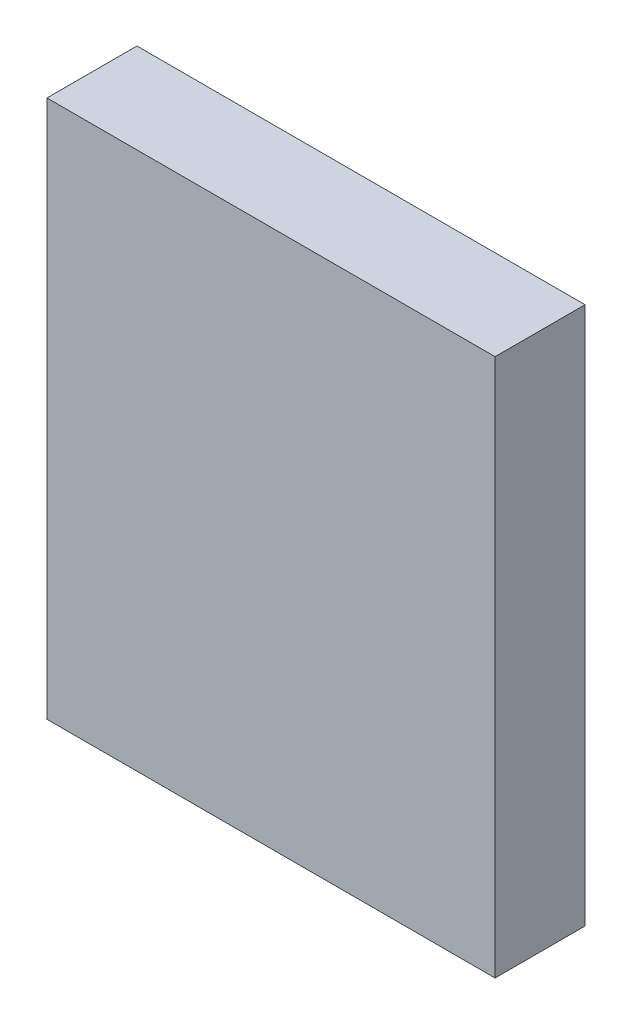
ISO-10303-21;
HEADER;
FILE_DESCRIPTION(('STEP AP214'),'2;1');
FILE_NAME('part.step','',(''),(''),'','','');
FILE_SCHEMA(('AUTOMOTIVE_DESIGN { 1 0 10303 214 1 1 1 1 }'));
ENDSEC;
DATA;
#1=APPLICATION_CONTEXT('core data for automotive mechanical design processes');
#2=APPLICATION_PROTOCOL_DEFINITION('international standard','automotive_design',2000,#1);
#3=PRODUCT_CONTEXT('',#1,'mechanical');
#4=PRODUCT('Part','Part','',(#3));
#5=PRODUCT_RELATED_PRODUCT_CATEGORY('part','',(#4));
#6=PRODUCT_DEFINITION_FORMATION('','',#4);
#7=PRODUCT_DEFINITION_CONTEXT('part definition',#1,'design');
#8=PRODUCT_DEFINITION('design','',#6,#7);
#9=PRODUCT_DEFINITION_SHAPE('','',#8);
#10=(LENGTH_UNIT() NAMED_UNIT(*) SI_UNIT(.MILLI.,.METRE.));
#11=(NAMED_UNIT(*) PLANE_ANGLE_UNIT() SI_UNIT($,.RADIAN.));
#12=(NAMED_UNIT(*) SI_UNIT($,.STERADIAN.) SOLID_ANGLE_UNIT());
#13=UNCERTAINTY_MEASURE_WITH_UNIT(LENGTH_MEASURE(1.E-05),#10,'distance_accuracy_value','');
#14=(GEOMETRIC_REPRESENTATION_CONTEXT(3) GLOBAL_UNCERTAINTY_ASSIGNED_CONTEXT((#13)) GLOBAL_UNIT_ASSIGNED_CONTEXT((#10,
#11,#12)) REPRESENTATION_CONTEXT('',''));
#15=CARTESIAN_POINT('',(0.,0.,0.));
#16=DIRECTION('',(0.,0.,1.));
#17=DIRECTION('',(1.,0.,0.));
#18=AXIS2_PLACEMENT_3D('',#15,#16,#17);
#19=CARTESIAN_POINT('',(-0.127,-1.003,0.));
#20=DIRECTION('',(0.,-1.,0.));
#21=DIRECTION('',(0.,0.,1.));
#22=AXIS2_PLACEMENT_3D('',#19,#20,#21);
#23=PLANE('',#22);
#24=DIRECTION('',(-1.,0.,0.));
#25=VECTOR('',#24,1.);
#26=CARTESIAN_POINT('',(0.127,-1.003,0.));
#27=LINE('',#26,#25);
#28=CARTESIAN_POINT('',(0.127,-1.003,0.));
#29=VERTEX_POINT('',#28);
#30=CARTESIAN_POINT('',(-0.127,-1.003,0.));
#31=VERTEX_POINT('',#30);
#32=EDGE_CURVE('E11',#29,#31,#27,.T.);
#33=ORIENTED_EDGE('',*,*,#32,.F.);
#34=DIRECTION('',(0.,0.,-1.));
#35=VECTOR('',#34,1.);
#36=CARTESIAN_POINT('',(0.127,-1.003,0.051));
#37=LINE('',#36,#35);
#38=CARTESIAN_POINT('',(0.127,-1.003,0.051));
#39=VERTEX_POINT('',#38);
#40=EDGE_CURVE('E24',#39,#29,#37,.T.);
#41=ORIENTED_EDGE('',*,*,#40,.F.);
#42=DIRECTION('',(1.,0.,0.));
#43=VECTOR('',#42,1.);
#44=CARTESIAN_POINT('',(-0.127,-1.003,0.051));
#45=LINE('',#44,#43);
#46=CARTESIAN_POINT('',(-0.127,-1.003,0.051));
#47=VERTEX_POINT('',#46);
#48=EDGE_CURVE('E88',#47,#39,#45,.T.);
#49=ORIENTED_EDGE('',*,*,#48,.F.);
#50=DIRECTION('',(0.,0.,1.));
#51=VECTOR('',#50,1.);
#52=CARTESIAN_POINT('',(-0.127,-1.003,0.));
#53=LINE('',#52,#51);
#54=EDGE_CURVE('E77',#31,#47,#53,.T.);
#55=ORIENTED_EDGE('',*,*,#54,.F.);
#56=EDGE_LOOP('',(#33,#41,#49,#55));
#57=FACE_BOUND('',#56,.T.);
#58=ADVANCED_FACE('F17',(#57),#23,.T.);
#59=CARTESIAN_POINT('',(0.127,-1.003,0.));
#60=DIRECTION('',(1.,0.,0.));
#61=DIRECTION('',(0.,0.,1.));
#62=AXIS2_PLACEMENT_3D('',#59,#60,#61);
#63=PLANE('',#62);
#64=DIRECTION('',(0.,-1.,0.));
#65=VECTOR('',#64,1.);
#66=CARTESIAN_POINT('',(0.127,-0.698,0.));
#67=LINE('',#66,#65);
#68=CARTESIAN_POINT('',(0.127,-0.698,0.));
#69=VERTEX_POINT('',#68);
#70=EDGE_CURVE('E85',#69,#29,#67,.T.);
#71=ORIENTED_EDGE('',*,*,#70,.F.);
#72=DIRECTION('',(0.,0.,-1.));
#73=VECTOR('',#72,1.);
#74=CARTESIAN_POINT('',(0.127,-0.698,0.051));
#75=LINE('',#74,#73);
#76=CARTESIAN_POINT('',(0.127,-0.698,0.051));
#77=VERTEX_POINT('',#76);
#78=EDGE_CURVE('E83',#77,#69,#75,.T.);
#79=ORIENTED_EDGE('',*,*,#78,.F.);
#80=DIRECTION('',(0.,1.,0.));
#81=VECTOR('',#80,1.);
#82=CARTESIAN_POINT('',(0.127,-1.003,0.051));
#83=LINE('',#82,#81);
#84=EDGE_CURVE('E72',#39,#77,#83,.T.);
#85=ORIENTED_EDGE('',*,*,#84,.F.);
#86=ORIENTED_EDGE('',*,*,#40,.T.);
#87=EDGE_LOOP('',(#71,#79,#85,#86));
#88=FACE_BOUND('',#87,.T.);
#89=ADVANCED_FACE('F90',(#88),#63,.T.);
#90=CARTESIAN_POINT('',(0.127,-0.698,0.));
#91=DIRECTION('',(0.,1.,0.));
#92=DIRECTION('',(0.,0.,1.));
#93=AXIS2_PLACEMENT_3D('',#90,#91,#92);
#94=PLANE('',#93);
#95=DIRECTION('',(1.,0.,0.));
#96=VECTOR('',#95,1.);
#97=CARTESIAN_POINT('',(-0.127,-0.698,0.));
#98=LINE('',#97,#96);
#99=CARTESIAN_POINT('',(-0.127,-0.698,0.));
#100=VERTEX_POINT('',#99);
#101=EDGE_CURVE('E60',#100,#69,#98,.T.);
#102=ORIENTED_EDGE('',*,*,#101,.F.);
#103=DIRECTION('',(0.,0.,-1.));
#104=VECTOR('',#103,1.);
#105=CARTESIAN_POINT('',(-0.127,-0.698,0.051));
#106=LINE('',#105,#104);
#107=CARTESIAN_POINT('',(-0.127,-0.698,0.051));
#108=VERTEX_POINT('',#107);
#109=EDGE_CURVE('E54',#108,#100,#106,.T.);
#110=ORIENTED_EDGE('',*,*,#109,.F.);
#111=DIRECTION('',(-1.,0.,0.));
#112=VECTOR('',#111,1.);
#113=CARTESIAN_POINT('',(0.127,-0.698,0.051));
#114=LINE('',#113,#112);
#115=EDGE_CURVE('E58',#77,#108,#114,.T.);
#116=ORIENTED_EDGE('',*,*,#115,.F.);
#117=ORIENTED_EDGE('',*,*,#78,.T.);
#118=EDGE_LOOP('',(#102,#110,#116,#117));
#119=FACE_BOUND('',#118,.T.);
#120=ADVANCED_FACE('F56',(#119),#94,.T.);
#121=CARTESIAN_POINT('',(-0.127,-0.698,0.));
#122=DIRECTION('',(-1.,0.,0.));
#123=DIRECTION('',(0.,0.,1.));
#124=AXIS2_PLACEMENT_3D('',#121,#122,#123);
#125=PLANE('',#124);
#126=DIRECTION('',(0.,1.,0.));
#127=VECTOR('',#126,1.);
#128=CARTESIAN_POINT('',(-0.127,-1.003,0.));
#129=LINE('',#128,#127);
#130=EDGE_CURVE('E73',#31,#100,#129,.T.);
#131=ORIENTED_EDGE('',*,*,#130,.F.);
#132=ORIENTED_EDGE('',*,*,#54,.T.);
#133=DIRECTION('',(0.,-1.,0.));
#134=VECTOR('',#133,1.);
#135=CARTESIAN_POINT('',(-0.127,-0.698,0.051));
#136=LINE('',#135,#134);
#137=EDGE_CURVE('E70',#108,#47,#136,.T.);
#138=ORIENTED_EDGE('',*,*,#137,.F.);
#139=ORIENTED_EDGE('',*,*,#109,.T.);
#140=EDGE_LOOP('',(#131,#132,#138,#139));
#141=FACE_BOUND('',#140,.T.);
#142=ADVANCED_FACE('F76',(#141),#125,.T.);
#143=CARTESIAN_POINT('',(-0.127,-0.698,0.));
#144=DIRECTION('',(0.,0.,-1.));
#145=DIRECTION('',(0.,1.,0.));
#146=AXIS2_PLACEMENT_3D('',#143,#144,#145);
#147=PLANE('',#146);
#148=ORIENTED_EDGE('',*,*,#101,.T.);
#149=ORIENTED_EDGE('',*,*,#70,.T.);
#150=ORIENTED_EDGE('',*,*,#32,.T.);
#151=ORIENTED_EDGE('',*,*,#130,.T.);
#152=EDGE_LOOP('',(#148,#149,#150,#151));
#153=FACE_BOUND('',#152,.T.);
#154=ADVANCED_FACE('F91',(#153),#147,.T.);
#155=CARTESIAN_POINT('',(-0.127,-1.003,0.051));
#156=DIRECTION('',(0.,0.,1.));
#157=DIRECTION('',(0.,1.,0.));
#158=AXIS2_PLACEMENT_3D('',#155,#156,#157);
#159=PLANE('',#158);
#160=ORIENTED_EDGE('',*,*,#48,.T.);
#161=ORIENTED_EDGE('',*,*,#84,.T.);
#162=ORIENTED_EDGE('',*,*,#115,.T.);
#163=ORIENTED_EDGE('',*,*,#137,.T.);
#164=EDGE_LOOP('',(#160,#161,#162,#163));
#165=FACE_BOUND('',#164,.T.);
#166=ADVANCED_FACE('F69',(#165),#159,.T.);
#167=CLOSED_SHELL('',(#58,#89,#120,#142,#154,#166));
#168=MANIFOLD_SOLID_BREP('B1',#167);
#169=ADVANCED_BREP_SHAPE_REPRESENTATION('',(#18,#168),#14);
#170=SHAPE_DEFINITION_REPRESENTATION(#9,#169);
ENDSEC;
END-ISO-10303-21;
